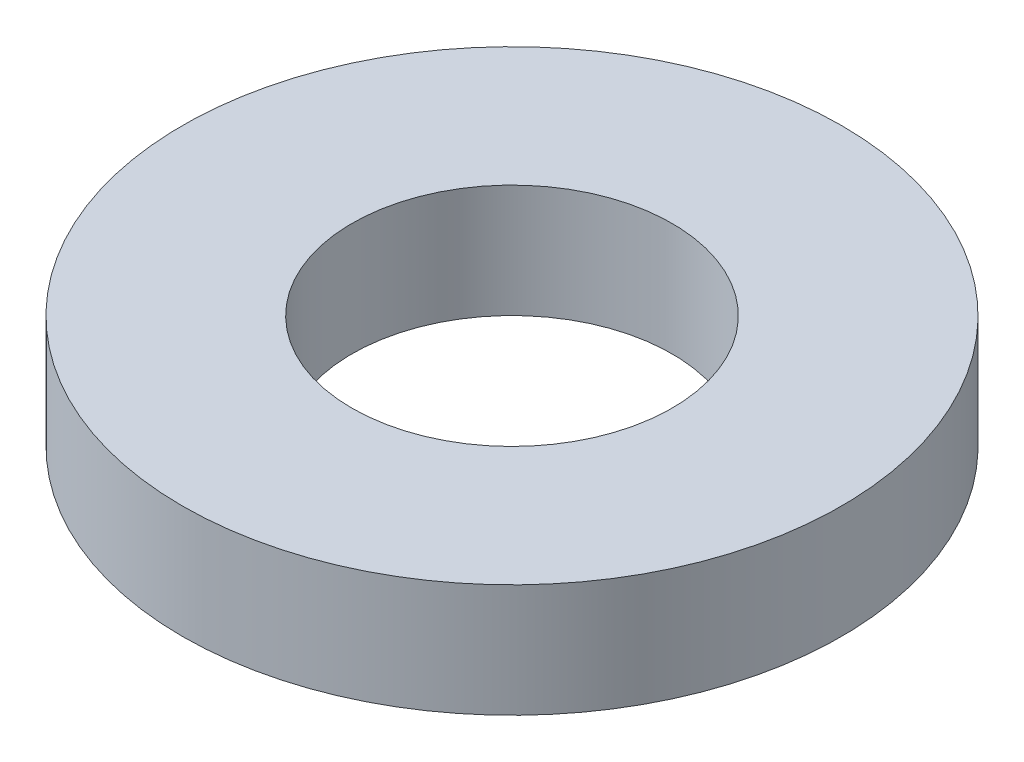
ISO-10303-21;
HEADER;
FILE_DESCRIPTION(('STEP AP214'),'2;1');
FILE_NAME('part.step','',(''),(''),'','','');
FILE_SCHEMA(('AUTOMOTIVE_DESIGN { 1 0 10303 214 1 1 1 1 }'));
ENDSEC;
DATA;
#1=APPLICATION_CONTEXT('core data for automotive mechanical design processes');
#2=APPLICATION_PROTOCOL_DEFINITION('international standard','automotive_design',2000,#1);
#3=PRODUCT_CONTEXT('',#1,'mechanical');
#4=PRODUCT('Part','Part','',(#3));
#5=PRODUCT_RELATED_PRODUCT_CATEGORY('part','',(#4));
#6=PRODUCT_DEFINITION_FORMATION('','',#4);
#7=PRODUCT_DEFINITION_CONTEXT('part definition',#1,'design');
#8=PRODUCT_DEFINITION('design','',#6,#7);
#9=PRODUCT_DEFINITION_SHAPE('','',#8);
#10=(LENGTH_UNIT() NAMED_UNIT(*) SI_UNIT(.MILLI.,.METRE.));
#11=(NAMED_UNIT(*) PLANE_ANGLE_UNIT() SI_UNIT($,.RADIAN.));
#12=(NAMED_UNIT(*) SI_UNIT($,.STERADIAN.) SOLID_ANGLE_UNIT());
#13=UNCERTAINTY_MEASURE_WITH_UNIT(LENGTH_MEASURE(1.E-05),#10,'distance_accuracy_value','');
#14=(GEOMETRIC_REPRESENTATION_CONTEXT(3) GLOBAL_UNCERTAINTY_ASSIGNED_CONTEXT((#13)) GLOBAL_UNIT_ASSIGNED_CONTEXT((#10,
#11,#12)) REPRESENTATION_CONTEXT('',''));
#15=CARTESIAN_POINT('',(0.,0.,0.));
#16=DIRECTION('',(0.,0.,1.));
#17=DIRECTION('',(1.,0.,0.));
#18=AXIS2_PLACEMENT_3D('',#15,#16,#17);
#19=CARTESIAN_POINT('',(0.,30.,0.));
#20=DIRECTION('',(0.,-1.,0.));
#21=DIRECTION('',(0.,0.,-1.));
#22=AXIS2_PLACEMENT_3D('',#19,#20,#21);
#23=CYLINDRICAL_SURFACE('',#22,87.5);
#24=CARTESIAN_POINT('',(0.,30.,0.));
#25=DIRECTION('',(0.,1.,0.));
#26=DIRECTION('',(0.,0.,1.));
#27=AXIS2_PLACEMENT_3D('',#24,#25,#26);
#28=CIRCLE('',#27,87.5);
#29=CARTESIAN_POINT('',(0.,30.,87.5));
#30=VERTEX_POINT('',#29);
#31=EDGE_CURVE('E10',#30,#30,#28,.T.);
#32=ORIENTED_EDGE('',*,*,#31,.F.);
#33=EDGE_LOOP('',(#32));
#34=FACE_BOUND('',#33,.T.);
#35=CARTESIAN_POINT('',(0.,0.,0.));
#36=DIRECTION('',(0.,1.,0.));
#37=DIRECTION('',(0.,0.,1.));
#38=AXIS2_PLACEMENT_3D('',#35,#36,#37);
#39=CIRCLE('',#38,87.5);
#40=CARTESIAN_POINT('',(0.,0.,87.5));
#41=VERTEX_POINT('',#40);
#42=EDGE_CURVE('E37',#41,#41,#39,.T.);
#43=ORIENTED_EDGE('',*,*,#42,.T.);
#44=EDGE_LOOP('',(#43));
#45=FACE_BOUND('',#44,.T.);
#46=ADVANCED_FACE('F40',(#34,#45),#23,.T.);
#47=CARTESIAN_POINT('',(0.,30.,0.));
#48=DIRECTION('',(0.,1.,0.));
#49=DIRECTION('',(0.,0.,1.));
#50=AXIS2_PLACEMENT_3D('',#47,#48,#49);
#51=PLANE('',#50);
#52=CARTESIAN_POINT('',(0.,30.,0.));
#53=DIRECTION('',(0.,1.,0.));
#54=DIRECTION('',(0.,0.,1.));
#55=AXIS2_PLACEMENT_3D('',#52,#53,#54);
#56=CIRCLE('',#55,42.5);
#57=CARTESIAN_POINT('',(0.,30.,42.5));
#58=VERTEX_POINT('',#57);
#59=EDGE_CURVE('E50',#58,#58,#56,.T.);
#60=ORIENTED_EDGE('',*,*,#59,.F.);
#61=EDGE_LOOP('',(#60));
#62=FACE_BOUND('',#61,.T.);
#63=ORIENTED_EDGE('',*,*,#31,.T.);
#64=EDGE_LOOP('',(#63));
#65=FACE_BOUND('',#64,.T.);
#66=ADVANCED_FACE('F59',(#62,#65),#51,.T.);
#67=CARTESIAN_POINT('',(0.,0.,0.));
#68=DIRECTION('',(0.,1.,0.));
#69=DIRECTION('',(0.,0.,1.));
#70=AXIS2_PLACEMENT_3D('',#67,#68,#69);
#71=PLANE('',#70);
#72=CARTESIAN_POINT('',(0.,0.,0.));
#73=DIRECTION('',(0.,1.,0.));
#74=DIRECTION('',(0.,0.,1.));
#75=AXIS2_PLACEMENT_3D('',#72,#73,#74);
#76=CIRCLE('',#75,42.5);
#77=CARTESIAN_POINT('',(0.,0.,42.5));
#78=VERTEX_POINT('',#77);
#79=EDGE_CURVE('E47',#78,#78,#76,.T.);
#80=ORIENTED_EDGE('',*,*,#79,.T.);
#81=EDGE_LOOP('',(#80));
#82=FACE_BOUND('',#81,.T.);
#83=ORIENTED_EDGE('',*,*,#42,.F.);
#84=EDGE_LOOP('',(#83));
#85=FACE_BOUND('',#84,.T.);
#86=ADVANCED_FACE('F58',(#82,#85),#71,.F.);
#87=CARTESIAN_POINT('',(0.,30.,0.));
#88=DIRECTION('',(0.,-1.,0.));
#89=DIRECTION('',(0.,0.,-1.));
#90=AXIS2_PLACEMENT_3D('',#87,#88,#89);
#91=CYLINDRICAL_SURFACE('',#90,42.5);
#92=ORIENTED_EDGE('',*,*,#59,.T.);
#93=EDGE_LOOP('',(#92));
#94=FACE_BOUND('',#93,.T.);
#95=ORIENTED_EDGE('',*,*,#79,.F.);
#96=EDGE_LOOP('',(#95));
#97=FACE_BOUND('',#96,.T.);
#98=ADVANCED_FACE('F54',(#94,#97),#91,.F.);
#99=CLOSED_SHELL('',(#46,#66,#86,#98));
#100=MANIFOLD_SOLID_BREP('B2',#99);
#101=ADVANCED_BREP_SHAPE_REPRESENTATION('',(#18,#100),#14);
#102=SHAPE_DEFINITION_REPRESENTATION(#9,#101);
ENDSEC;
END-ISO-10303-21;
